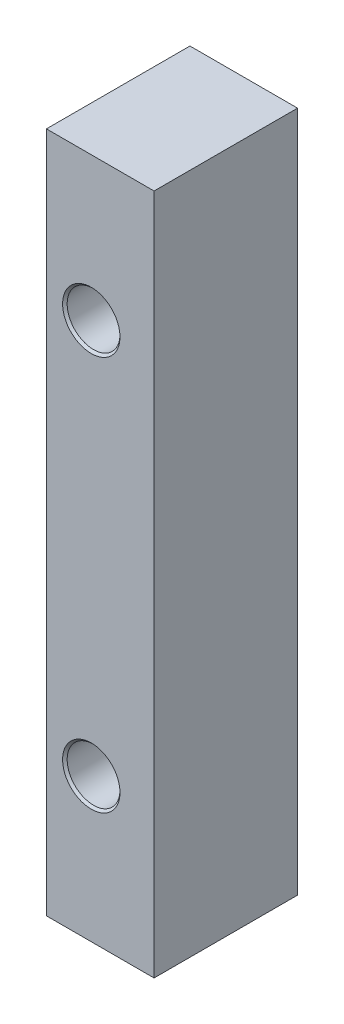
ISO-10303-21;
HEADER;
FILE_DESCRIPTION(('STEP AP214'),'2;1');
FILE_NAME('part.step','',(''),(''),'','','');
FILE_SCHEMA(('AUTOMOTIVE_DESIGN { 1 0 10303 214 1 1 1 1 }'));
ENDSEC;
DATA;
#1=APPLICATION_CONTEXT('core data for automotive mechanical design processes');
#2=APPLICATION_PROTOCOL_DEFINITION('international standard','automotive_design',2000,#1);
#3=PRODUCT_CONTEXT('',#1,'mechanical');
#4=PRODUCT('Part','Part','',(#3));
#5=PRODUCT_RELATED_PRODUCT_CATEGORY('part','',(#4));
#6=PRODUCT_DEFINITION_FORMATION('','',#4);
#7=PRODUCT_DEFINITION_CONTEXT('part definition',#1,'design');
#8=PRODUCT_DEFINITION('design','',#6,#7);
#9=PRODUCT_DEFINITION_SHAPE('','',#8);
#10=(LENGTH_UNIT() NAMED_UNIT(*) SI_UNIT(.MILLI.,.METRE.));
#11=(NAMED_UNIT(*) PLANE_ANGLE_UNIT() SI_UNIT($,.RADIAN.));
#12=(NAMED_UNIT(*) SI_UNIT($,.STERADIAN.) SOLID_ANGLE_UNIT());
#13=UNCERTAINTY_MEASURE_WITH_UNIT(LENGTH_MEASURE(1.E-05),#10,'distance_accuracy_value','');
#14=(GEOMETRIC_REPRESENTATION_CONTEXT(3) GLOBAL_UNCERTAINTY_ASSIGNED_CONTEXT((#13)) GLOBAL_UNIT_ASSIGNED_CONTEXT((#10,
#11,#12)) REPRESENTATION_CONTEXT('',''));
#15=CARTESIAN_POINT('',(0.,0.,0.));
#16=DIRECTION('',(0.,0.,1.));
#17=DIRECTION('',(1.,0.,0.));
#18=AXIS2_PLACEMENT_3D('',#15,#16,#17);
#19=CARTESIAN_POINT('',(3.,-19.,8.));
#20=DIRECTION('',(-1.,0.,0.));
#21=DIRECTION('',(0.,0.,1.));
#22=AXIS2_PLACEMENT_3D('',#19,#20,#21);
#23=PLANE('',#22);
#24=DIRECTION('',(0.,1.,0.));
#25=VECTOR('',#24,1.);
#26=CARTESIAN_POINT('',(3.,-19.,0.));
#27=LINE('',#26,#25);
#28=CARTESIAN_POINT('',(3.,-19.,0.));
#29=VERTEX_POINT('',#28);
#30=CARTESIAN_POINT('',(3.,19.,0.));
#31=VERTEX_POINT('',#30);
#32=EDGE_CURVE('E155',#29,#31,#27,.T.);
#33=ORIENTED_EDGE('',*,*,#32,.T.);
#34=DIRECTION('',(0.,0.,-1.));
#35=VECTOR('',#34,1.);
#36=CARTESIAN_POINT('',(3.,19.,8.));
#37=LINE('',#36,#35);
#38=CARTESIAN_POINT('',(3.,19.,8.));
#39=VERTEX_POINT('',#38);
#40=EDGE_CURVE('E136',#39,#31,#37,.T.);
#41=ORIENTED_EDGE('',*,*,#40,.F.);
#42=DIRECTION('',(0.,1.,0.));
#43=VECTOR('',#42,1.);
#44=CARTESIAN_POINT('',(3.,-19.,8.));
#45=LINE('',#44,#43);
#46=CARTESIAN_POINT('',(3.,-19.,8.));
#47=VERTEX_POINT('',#46);
#48=EDGE_CURVE('E143',#47,#39,#45,.T.);
#49=ORIENTED_EDGE('',*,*,#48,.F.);
#50=DIRECTION('',(0.,0.,-1.));
#51=VECTOR('',#50,1.);
#52=CARTESIAN_POINT('',(3.,-19.,8.));
#53=LINE('',#52,#51);
#54=EDGE_CURVE('E343',#47,#29,#53,.T.);
#55=ORIENTED_EDGE('',*,*,#54,.T.);
#56=EDGE_LOOP('',(#33,#41,#49,#55));
#57=FACE_BOUND('',#56,.T.);
#58=ADVANCED_FACE('F31',(#57),#23,.F.);
#59=CARTESIAN_POINT('',(-3.,19.,8.));
#60=DIRECTION('',(0.,-1.,0.));
#61=DIRECTION('',(0.,0.,-1.));
#62=AXIS2_PLACEMENT_3D('',#59,#60,#61);
#63=PLANE('',#62);
#64=DIRECTION('',(-1.,0.,0.));
#65=VECTOR('',#64,1.);
#66=CARTESIAN_POINT('',(-3.,19.,0.));
#67=LINE('',#66,#65);
#68=CARTESIAN_POINT('',(-3.,19.,0.));
#69=VERTEX_POINT('',#68);
#70=EDGE_CURVE('E345',#31,#69,#67,.T.);
#71=ORIENTED_EDGE('',*,*,#70,.T.);
#72=DIRECTION('',(0.,0.,-1.));
#73=VECTOR('',#72,1.);
#74=CARTESIAN_POINT('',(-3.,19.,8.));
#75=LINE('',#74,#73);
#76=CARTESIAN_POINT('',(-3.,19.,8.));
#77=VERTEX_POINT('',#76);
#78=EDGE_CURVE('E139',#77,#69,#75,.T.);
#79=ORIENTED_EDGE('',*,*,#78,.F.);
#80=DIRECTION('',(-1.,0.,0.));
#81=VECTOR('',#80,1.);
#82=CARTESIAN_POINT('',(-3.,19.,8.));
#83=LINE('',#82,#81);
#84=EDGE_CURVE('E132',#39,#77,#83,.T.);
#85=ORIENTED_EDGE('',*,*,#84,.F.);
#86=ORIENTED_EDGE('',*,*,#40,.T.);
#87=EDGE_LOOP('',(#71,#79,#85,#86));
#88=FACE_BOUND('',#87,.T.);
#89=ADVANCED_FACE('F134',(#88),#63,.F.);
#90=CARTESIAN_POINT('',(-3.,-19.,8.));
#91=DIRECTION('',(1.,0.,0.));
#92=DIRECTION('',(0.,0.,-1.));
#93=AXIS2_PLACEMENT_3D('',#90,#91,#92);
#94=PLANE('',#93);
#95=DIRECTION('',(0.,-1.,0.));
#96=VECTOR('',#95,1.);
#97=CARTESIAN_POINT('',(-3.,-19.,0.));
#98=LINE('',#97,#96);
#99=CARTESIAN_POINT('',(-3.,9.3375451121956,0.));
#100=VERTEX_POINT('',#99);
#101=CARTESIAN_POINT('',(-3.,-9.33754511219559,0.));
#102=VERTEX_POINT('',#101);
#103=EDGE_CURVE('E350',#100,#102,#98,.T.);
#104=ORIENTED_EDGE('',*,*,#103,.T.);
#105=DIRECTION('',(0.,0.,1.));
#106=VECTOR('',#105,1.);
#107=CARTESIAN_POINT('',(-3.,-9.33754511219559,8.));
#108=LINE('',#107,#106);
#109=CARTESIAN_POINT('',(-3.,-9.33754511219559,2.8448));
#110=VERTEX_POINT('',#109);
#111=EDGE_CURVE('E174',#102,#110,#108,.T.);
#112=ORIENTED_EDGE('',*,*,#111,.T.);
#113=DIRECTION('',(0.,-1.,0.));
#114=VECTOR('',#113,1.);
#115=CARTESIAN_POINT('',(-3.,-19.,2.8448));
#116=LINE('',#115,#114);
#117=CARTESIAN_POINT('',(-3.,-12.6624548878044,2.8448));
#118=VERTEX_POINT('',#117);
#119=EDGE_CURVE('E156',#110,#118,#116,.T.);
#120=ORIENTED_EDGE('',*,*,#119,.T.);
#121=DIRECTION('',(0.,0.,-1.));
#122=VECTOR('',#121,1.);
#123=CARTESIAN_POINT('',(-3.,-12.6624548878044,8.));
#124=LINE('',#123,#122);
#125=CARTESIAN_POINT('',(-3.,-12.6624548878044,0.));
#126=VERTEX_POINT('',#125);
#127=EDGE_CURVE('E171',#118,#126,#124,.T.);
#128=ORIENTED_EDGE('',*,*,#127,.T.);
#129=CARTESIAN_POINT('',(-3.,-19.,0.));
#130=VERTEX_POINT('',#129);
#131=EDGE_CURVE('E347',#126,#130,#98,.T.);
#132=ORIENTED_EDGE('',*,*,#131,.T.);
#133=DIRECTION('',(0.,0.,-1.));
#134=VECTOR('',#133,1.);
#135=CARTESIAN_POINT('',(-3.,-19.,8.));
#136=LINE('',#135,#134);
#137=CARTESIAN_POINT('',(-3.,-19.,8.));
#138=VERTEX_POINT('',#137);
#139=EDGE_CURVE('E160',#138,#130,#136,.T.);
#140=ORIENTED_EDGE('',*,*,#139,.F.);
#141=DIRECTION('',(0.,-1.,0.));
#142=VECTOR('',#141,1.);
#143=CARTESIAN_POINT('',(-3.,-19.,8.));
#144=LINE('',#143,#142);
#145=EDGE_CURVE('E142',#77,#138,#144,.T.);
#146=ORIENTED_EDGE('',*,*,#145,.F.);
#147=ORIENTED_EDGE('',*,*,#78,.T.);
#148=CARTESIAN_POINT('',(-3.,12.6624548878044,0.));
#149=VERTEX_POINT('',#148);
#150=EDGE_CURVE('E348',#69,#149,#98,.T.);
#151=ORIENTED_EDGE('',*,*,#150,.T.);
#152=DIRECTION('',(0.,0.,1.));
#153=VECTOR('',#152,1.);
#154=CARTESIAN_POINT('',(-3.,12.6624548878044,8.));
#155=LINE('',#154,#153);
#156=CARTESIAN_POINT('',(-3.,12.6624548878044,2.8448));
#157=VERTEX_POINT('',#156);
#158=EDGE_CURVE('E165',#149,#157,#155,.T.);
#159=ORIENTED_EDGE('',*,*,#158,.T.);
#160=DIRECTION('',(0.,-1.,0.));
#161=VECTOR('',#160,1.);
#162=CARTESIAN_POINT('',(-3.,-19.,2.8448));
#163=LINE('',#162,#161);
#164=CARTESIAN_POINT('',(-3.,9.3375451121956,2.8448));
#165=VERTEX_POINT('',#164);
#166=EDGE_CURVE('E158',#157,#165,#163,.T.);
#167=ORIENTED_EDGE('',*,*,#166,.T.);
#168=DIRECTION('',(0.,0.,-1.));
#169=VECTOR('',#168,1.);
#170=CARTESIAN_POINT('',(-3.,9.3375451121956,8.));
#171=LINE('',#170,#169);
#172=EDGE_CURVE('E168',#165,#100,#171,.T.);
#173=ORIENTED_EDGE('',*,*,#172,.T.);
#174=EDGE_LOOP('',(#104,#112,#120,#128,#132,#140,#146,#147,#151,#159,#167,#173));
#175=FACE_BOUND('',#174,.T.);
#176=ADVANCED_FACE('F236',(#175),#94,.F.);
#177=CARTESIAN_POINT('',(-3.,-19.,8.));
#178=DIRECTION('',(0.,1.,0.));
#179=DIRECTION('',(0.,0.,1.));
#180=AXIS2_PLACEMENT_3D('',#177,#178,#179);
#181=PLANE('',#180);
#182=DIRECTION('',(1.,0.,0.));
#183=VECTOR('',#182,1.);
#184=CARTESIAN_POINT('',(-3.,-19.,0.));
#185=LINE('',#184,#183);
#186=EDGE_CURVE('E152',#130,#29,#185,.T.);
#187=ORIENTED_EDGE('',*,*,#186,.T.);
#188=ORIENTED_EDGE('',*,*,#54,.F.);
#189=DIRECTION('',(1.,0.,0.));
#190=VECTOR('',#189,1.);
#191=CARTESIAN_POINT('',(-3.,-19.,8.));
#192=LINE('',#191,#190);
#193=EDGE_CURVE('E148',#138,#47,#192,.T.);
#194=ORIENTED_EDGE('',*,*,#193,.F.);
#195=ORIENTED_EDGE('',*,*,#139,.T.);
#196=EDGE_LOOP('',(#187,#188,#194,#195));
#197=FACE_BOUND('',#196,.T.);
#198=ADVANCED_FACE('F229',(#197),#181,.F.);
#199=CARTESIAN_POINT('',(3.,19.,8.));
#200=DIRECTION('',(0.,0.,-1.));
#201=DIRECTION('',(-1.,0.,0.));
#202=AXIS2_PLACEMENT_3D('',#199,#200,#201);
#203=PLANE('',#202);
#204=CARTESIAN_POINT('',(-0.5,11.,8.));
#205=DIRECTION('',(0.,0.,-1.));
#206=DIRECTION('',(-1.,0.,0.));
#207=AXIS2_PLACEMENT_3D('',#204,#205,#206);
#208=CIRCLE('',#207,1.6002);
#209=CARTESIAN_POINT('',(-2.1002,11.,8.));
#210=VERTEX_POINT('',#209);
#211=EDGE_CURVE('E384',#210,#210,#208,.T.);
#212=ORIENTED_EDGE('',*,*,#211,.T.);
#213=EDGE_LOOP('',(#212));
#214=FACE_BOUND('',#213,.T.);
#215=CARTESIAN_POINT('',(-0.5,-11.,8.));
#216=DIRECTION('',(0.,0.,-1.));
#217=DIRECTION('',(-1.,0.,0.));
#218=AXIS2_PLACEMENT_3D('',#215,#216,#217);
#219=CIRCLE('',#218,1.6002);
#220=CARTESIAN_POINT('',(-2.1002,-11.,8.));
#221=VERTEX_POINT('',#220);
#222=EDGE_CURVE('E315',#221,#221,#219,.T.);
#223=ORIENTED_EDGE('',*,*,#222,.T.);
#224=EDGE_LOOP('',(#223));
#225=FACE_BOUND('',#224,.T.);
#226=ORIENTED_EDGE('',*,*,#48,.T.);
#227=ORIENTED_EDGE('',*,*,#84,.T.);
#228=ORIENTED_EDGE('',*,*,#145,.T.);
#229=ORIENTED_EDGE('',*,*,#193,.T.);
#230=EDGE_LOOP('',(#226,#227,#228,#229));
#231=FACE_BOUND('',#230,.T.);
#232=ADVANCED_FACE('F146',(#214,#225,#231),#203,.F.);
#233=CARTESIAN_POINT('',(3.,19.,0.));
#234=DIRECTION('',(0.,0.,-1.));
#235=DIRECTION('',(-1.,0.,0.));
#236=AXIS2_PLACEMENT_3D('',#233,#234,#235);
#237=PLANE('',#236);
#238=CARTESIAN_POINT('',(-0.5,-11.,0.));
#239=DIRECTION('',(0.,0.,-1.));
#240=DIRECTION('',(-1.,0.,0.));
#241=AXIS2_PLACEMENT_3D('',#238,#239,#240);
#242=CIRCLE('',#241,2.90576);
#243=CARTESIAN_POINT('',(-2.88304335898056,-9.33730774741125,0.));
#244=VERTEX_POINT('',#243);
#245=CARTESIAN_POINT('',(-2.88304335898056,-12.6626922525887,0.));
#246=VERTEX_POINT('',#245);
#247=EDGE_CURVE('E324',#244,#246,#242,.T.);
#248=ORIENTED_EDGE('',*,*,#247,.F.);
#249=DIRECTION('',(-0.999997940549001,-0.00202950677646933,0.));
#250=VECTOR('',#249,1.);
#251=CARTESIAN_POINT('',(3.05748640800559,-9.32525137716383,0.));
#252=LINE('',#251,#250);
#253=EDGE_CURVE('E263',#244,#102,#252,.T.);
#254=ORIENTED_EDGE('',*,*,#253,.T.);
#255=ORIENTED_EDGE('',*,*,#103,.F.);
#256=DIRECTION('',(-0.999997940549001,0.00202950677646934,0.));
#257=VECTOR('',#256,1.);
#258=CARTESIAN_POINT('',(2.98036530932721,9.32540789527856,0.));
#259=LINE('',#258,#257);
#260=CARTESIAN_POINT('',(-2.88304335898056,9.33730774741126,0.));
#261=VERTEX_POINT('',#260);
#262=EDGE_CURVE('E268',#100,#261,#259,.F.);
#263=ORIENTED_EDGE('',*,*,#262,.T.);
#264=CARTESIAN_POINT('',(-0.5,11.,0.));
#265=DIRECTION('',(0.,0.,-1.));
#266=DIRECTION('',(-1.,0.,0.));
#267=AXIS2_PLACEMENT_3D('',#264,#265,#266);
#268=CIRCLE('',#267,2.90576);
#269=CARTESIAN_POINT('',(-2.88304335898056,12.6626922525888,0.));
#270=VERTEX_POINT('',#269);
#271=EDGE_CURVE('E382',#270,#261,#268,.T.);
#272=ORIENTED_EDGE('',*,*,#271,.F.);
#273=DIRECTION('',(-0.999997940549001,-0.00202950677646933,0.));
#274=VECTOR('',#273,1.);
#275=CARTESIAN_POINT('',(3.012837350876,12.6746580070855,0.));
#276=LINE('',#275,#274);
#277=EDGE_CURVE('E267',#270,#149,#276,.T.);
#278=ORIENTED_EDGE('',*,*,#277,.T.);
#279=ORIENTED_EDGE('',*,*,#150,.F.);
#280=ORIENTED_EDGE('',*,*,#70,.F.);
#281=ORIENTED_EDGE('',*,*,#32,.F.);
#282=ORIENTED_EDGE('',*,*,#186,.F.);
#283=ORIENTED_EDGE('',*,*,#131,.F.);
#284=DIRECTION('',(-0.999997940549001,0.00202950677646934,0.));
#285=VECTOR('',#284,1.);
#286=CARTESIAN_POINT('',(2.93571625219762,-12.6745014889708,0.));
#287=LINE('',#286,#285);
#288=EDGE_CURVE('E273',#126,#246,#287,.F.);
#289=ORIENTED_EDGE('',*,*,#288,.T.);
#290=EDGE_LOOP('',(#248,#254,#255,#263,#272,#278,#279,#280,#281,#282,#283,#289));
#291=FACE_BOUND('',#290,.T.);
#292=ADVANCED_FACE('F213',(#291),#237,.T.);
#293=CARTESIAN_POINT('',(1.1002,-11.,2.8448));
#294=DIRECTION('',(0.,0.,1.));
#295=DIRECTION('',(1.,0.,0.));
#296=AXIS2_PLACEMENT_3D('',#293,#294,#295);
#297=PLANE('',#296);
#298=CARTESIAN_POINT('',(-0.5,-11.,2.8448));
#299=DIRECTION('',(0.,0.,-1.));
#300=DIRECTION('',(-1.,0.,0.));
#301=AXIS2_PLACEMENT_3D('',#298,#299,#300);
#302=CIRCLE('',#301,1.6002);
#303=CARTESIAN_POINT('',(-2.1002,-11.,2.8448));
#304=VERTEX_POINT('',#303);
#305=EDGE_CURVE('E332',#304,#304,#302,.T.);
#306=ORIENTED_EDGE('',*,*,#305,.F.);
#307=EDGE_LOOP('',(#306));
#308=FACE_BOUND('',#307,.T.);
#309=ORIENTED_EDGE('',*,*,#119,.F.);
#310=DIRECTION('',(0.999997940549001,0.00202950677646933,0.));
#311=VECTOR('',#310,1.);
#312=CARTESIAN_POINT('',(1.09680915518356,-9.3292305931299,2.8448));
#313=LINE('',#312,#311);
#314=CARTESIAN_POINT('',(-2.72618572726878,-9.33698940312913,2.8448));
#315=VERTEX_POINT('',#314);
#316=EDGE_CURVE('E363',#110,#315,#313,.T.);
#317=ORIENTED_EDGE('',*,*,#316,.T.);
#318=CARTESIAN_POINT('',(-0.5,-11.,2.8448));
#319=DIRECTION('',(0.,0.,-1.));
#320=DIRECTION('',(-1.,0.,0.));
#321=AXIS2_PLACEMENT_3D('',#318,#319,#320);
#322=CIRCLE('',#321,2.77876);
#323=CARTESIAN_POINT('',(-2.72618572726878,-12.6630105968709,2.8448));
#324=VERTEX_POINT('',#323);
#325=EDGE_CURVE('E329',#315,#324,#322,.T.);
#326=ORIENTED_EDGE('',*,*,#325,.T.);
#327=DIRECTION('',(0.999997940549001,-0.00202950677646934,0.));
#328=VECTOR('',#327,1.);
#329=CARTESIAN_POINT('',(1.09680915518356,-12.6707694068701,2.8448));
#330=LINE('',#329,#328);
#331=EDGE_CURVE('E367',#324,#118,#330,.F.);
#332=ORIENTED_EDGE('',*,*,#331,.T.);
#333=EDGE_LOOP('',(#309,#317,#326,#332));
#334=FACE_BOUND('',#333,.T.);
#335=ADVANCED_FACE('F209',(#308,#334),#297,.F.);
#336=CARTESIAN_POINT('',(-0.5,-11.,0.));
#337=DIRECTION('',(0.,0.,-1.));
#338=DIRECTION('',(-1.,0.,0.));
#339=AXIS2_PLACEMENT_3D('',#336,#337,#338);
#340=CYLINDRICAL_SURFACE('',#339,2.77876);
#341=ORIENTED_EDGE('',*,*,#325,.F.);
#342=DIRECTION('',(0.,0.,-1.));
#343=VECTOR('',#342,1.);
#344=CARTESIAN_POINT('',(-2.72618572726878,-9.33698940312913,0.));
#345=LINE('',#344,#343);
#346=CARTESIAN_POINT('',(-2.72618572726878,-9.33698940312913,0.127000000000001));
#347=VERTEX_POINT('',#346);
#348=EDGE_CURVE('E179',#315,#347,#345,.T.);
#349=ORIENTED_EDGE('',*,*,#348,.T.);
#350=CARTESIAN_POINT('',(-0.5,-11.,0.127000000000001));
#351=DIRECTION('',(0.,0.,-1.));
#352=DIRECTION('',(-1.,0.,0.));
#353=AXIS2_PLACEMENT_3D('',#350,#351,#352);
#354=CIRCLE('',#353,2.77876);
#355=CARTESIAN_POINT('',(-2.72618572726878,-12.6630105968709,0.127000000000001));
#356=VERTEX_POINT('',#355);
#357=EDGE_CURVE('E326',#347,#356,#354,.T.);
#358=ORIENTED_EDGE('',*,*,#357,.T.);
#359=DIRECTION('',(0.,0.,-1.));
#360=VECTOR('',#359,1.);
#361=CARTESIAN_POINT('',(-2.72618572726878,-12.6630105968709,0.));
#362=LINE('',#361,#360);
#363=EDGE_CURVE('E177',#356,#324,#362,.F.);
#364=ORIENTED_EDGE('',*,*,#363,.T.);
#365=EDGE_LOOP('',(#341,#349,#358,#364));
#366=FACE_BOUND('',#365,.T.);
#367=ADVANCED_FACE('F202',(#366),#340,.F.);
#368=CARTESIAN_POINT('',(-0.5,-11.,0.));
#369=DIRECTION('',(0.,0.,-1.));
#370=DIRECTION('',(-1.,0.,0.));
#371=AXIS2_PLACEMENT_3D('',#368,#369,#370);
#372=CONICAL_SURFACE('',#371,2.90576,0.785398163397448);
#373=ORIENTED_EDGE('',*,*,#357,.F.);
#374=CARTESIAN_POINT('',(-2.72618572726878,-9.33698940312913,0.127000000000001));
#375=CARTESIAN_POINT('',(-2.75245019923403,-9.33704270716274,0.105983429878905));
#376=CARTESIAN_POINT('',(-2.77865390692182,-9.33709588787459,0.0848918095223424));
#377=CARTESIAN_POINT('',(-2.83093978411433,-9.3372020026352,0.0425584761337284));
#378=CARTESIAN_POINT('',(-2.8570219536638,-9.33725493668406,0.0213167631569572));
#379=CARTESIAN_POINT('',(-2.88304335898056,-9.33730774741125,0.));
#380=B_SPLINE_CURVE_WITH_KNOTS('',3,(#374,#375,#376,#377,#378,#379),.UNSPECIFIED.,.F.,.F.,(4,2,
4),(0.,0.100913042597901,0.201826048030678),.UNSPECIFIED.);
#381=EDGE_CURVE('E188',#347,#244,#380,.T.);
#382=ORIENTED_EDGE('',*,*,#381,.T.);
#383=ORIENTED_EDGE('',*,*,#247,.T.);
#384=CARTESIAN_POINT('',(-2.88304335898056,-12.6626922525887,0.));
#385=CARTESIAN_POINT('',(-2.8570219536638,-12.6627450633159,0.0213167631569573));
#386=CARTESIAN_POINT('',(-2.83093978411433,-12.6627979973648,0.0425584761337285));
#387=CARTESIAN_POINT('',(-2.77865390692182,-12.6629041121254,0.0848918095223423));
#388=CARTESIAN_POINT('',(-2.75245019923403,-12.6629572928372,0.105983429878905));
#389=CARTESIAN_POINT('',(-2.72618572726878,-12.6630105968709,0.127000000000001));
#390=B_SPLINE_CURVE_WITH_KNOTS('',3,(#384,#385,#386,#387,#388,#389),.UNSPECIFIED.,.F.,.F.,(4,2,
4),(0.,0.100913005432776,0.201826048030677),.UNSPECIFIED.);
#391=EDGE_CURVE('E181',#246,#356,#390,.T.);
#392=ORIENTED_EDGE('',*,*,#391,.T.);
#393=EDGE_LOOP('',(#373,#382,#383,#392));
#394=FACE_BOUND('',#393,.T.);
#395=ADVANCED_FACE('F196',(#394),#372,.F.);
#396=CARTESIAN_POINT('',(-0.5,-11.,7.873));
#397=DIRECTION('',(0.,0.,1.));
#398=DIRECTION('',(1.,0.,0.));
#399=AXIS2_PLACEMENT_3D('',#396,#397,#398);
#400=CONICAL_SURFACE('',#399,1.4732,0.785398163397448);
#401=ORIENTED_EDGE('',*,*,#222,.F.);
#402=EDGE_LOOP('',(#401));
#403=FACE_BOUND('',#402,.T.);
#404=CARTESIAN_POINT('',(-0.5,-11.,7.873));
#405=DIRECTION('',(0.,0.,-1.));
#406=DIRECTION('',(-1.,0.,0.));
#407=AXIS2_PLACEMENT_3D('',#404,#405,#406);
#408=CIRCLE('',#407,1.4732);
#409=CARTESIAN_POINT('',(-1.9732,-11.,7.873));
#410=VERTEX_POINT('',#409);
#411=EDGE_CURVE('E338',#410,#410,#408,.T.);
#412=ORIENTED_EDGE('',*,*,#411,.T.);
#413=EDGE_LOOP('',(#412));
#414=FACE_BOUND('',#413,.T.);
#415=ADVANCED_FACE('F201',(#403,#414),#400,.F.);
#416=CARTESIAN_POINT('',(-0.5,-11.,0.));
#417=DIRECTION('',(0.,0.,-1.));
#418=DIRECTION('',(-1.,0.,0.));
#419=AXIS2_PLACEMENT_3D('',#416,#417,#418);
#420=CYLINDRICAL_SURFACE('',#419,1.4732);
#421=ORIENTED_EDGE('',*,*,#411,.F.);
#422=EDGE_LOOP('',(#421));
#423=FACE_BOUND('',#422,.T.);
#424=CARTESIAN_POINT('',(-0.5,-11.,2.9718));
#425=DIRECTION('',(0.,0.,-1.));
#426=DIRECTION('',(-1.,0.,0.));
#427=AXIS2_PLACEMENT_3D('',#424,#425,#426);
#428=CIRCLE('',#427,1.4732);
#429=CARTESIAN_POINT('',(-1.9732,-11.,2.9718));
#430=VERTEX_POINT('',#429);
#431=EDGE_CURVE('E335',#430,#430,#428,.T.);
#432=ORIENTED_EDGE('',*,*,#431,.T.);
#433=EDGE_LOOP('',(#432));
#434=FACE_BOUND('',#433,.T.);
#435=ADVANCED_FACE('F219',(#423,#434),#420,.F.);
#436=CARTESIAN_POINT('',(-0.5,-11.,2.8448));
#437=DIRECTION('',(0.,0.,-1.));
#438=DIRECTION('',(-1.,0.,0.));
#439=AXIS2_PLACEMENT_3D('',#436,#437,#438);
#440=CONICAL_SURFACE('',#439,1.6002,0.785398163397448);
#441=ORIENTED_EDGE('',*,*,#431,.F.);
#442=EDGE_LOOP('',(#441));
#443=FACE_BOUND('',#442,.T.);
#444=ORIENTED_EDGE('',*,*,#305,.T.);
#445=EDGE_LOOP('',(#444));
#446=FACE_BOUND('',#445,.T.);
#447=ADVANCED_FACE('F215',(#443,#446),#440,.F.);
#448=CARTESIAN_POINT('',(1.1002,11.,2.8448));
#449=DIRECTION('',(0.,0.,1.));
#450=DIRECTION('',(1.,0.,0.));
#451=AXIS2_PLACEMENT_3D('',#448,#449,#450);
#452=PLANE('',#451);
#453=CARTESIAN_POINT('',(-0.5,11.,2.8448));
#454=DIRECTION('',(0.,0.,-1.));
#455=DIRECTION('',(-1.,0.,0.));
#456=AXIS2_PLACEMENT_3D('',#453,#454,#455);
#457=CIRCLE('',#456,1.6002);
#458=CARTESIAN_POINT('',(-2.1002,11.,2.8448));
#459=VERTEX_POINT('',#458);
#460=EDGE_CURVE('E313',#459,#459,#457,.T.);
#461=ORIENTED_EDGE('',*,*,#460,.F.);
#462=EDGE_LOOP('',(#461));
#463=FACE_BOUND('',#462,.T.);
#464=ORIENTED_EDGE('',*,*,#166,.F.);
#465=DIRECTION('',(0.999997940549001,0.00202950677646933,0.));
#466=VECTOR('',#465,1.);
#467=CARTESIAN_POINT('',(1.09680915518356,12.6707694068701,2.8448));
#468=LINE('',#467,#466);
#469=CARTESIAN_POINT('',(-2.72618572726878,12.6630105968709,2.8448));
#470=VERTEX_POINT('',#469);
#471=EDGE_CURVE('E11',#157,#470,#468,.T.);
#472=ORIENTED_EDGE('',*,*,#471,.T.);
#473=CARTESIAN_POINT('',(-0.5,11.,2.8448));
#474=DIRECTION('',(0.,0.,-1.));
#475=DIRECTION('',(-1.,0.,0.));
#476=AXIS2_PLACEMENT_3D('',#473,#474,#475);
#477=CIRCLE('',#476,2.77876);
#478=CARTESIAN_POINT('',(-2.72618572726878,9.33698940312914,2.8448));
#479=VERTEX_POINT('',#478);
#480=EDGE_CURVE('E318',#470,#479,#477,.T.);
#481=ORIENTED_EDGE('',*,*,#480,.T.);
#482=DIRECTION('',(0.999997940549001,-0.00202950677646934,0.));
#483=VECTOR('',#482,1.);
#484=CARTESIAN_POINT('',(1.09680915518356,9.32923059312991,2.8448));
#485=LINE('',#484,#483);
#486=EDGE_CURVE('E40',#479,#165,#485,.F.);
#487=ORIENTED_EDGE('',*,*,#486,.T.);
#488=EDGE_LOOP('',(#464,#472,#481,#487));
#489=FACE_BOUND('',#488,.T.);
#490=ADVANCED_FACE('F218',(#463,#489),#452,.F.);
#491=CARTESIAN_POINT('',(-0.5,11.,0.));
#492=DIRECTION('',(0.,0.,-1.));
#493=DIRECTION('',(-1.,0.,0.));
#494=AXIS2_PLACEMENT_3D('',#491,#492,#493);
#495=CYLINDRICAL_SURFACE('',#494,2.77876);
#496=CARTESIAN_POINT('',(-0.5,11.,0.127000000000001));
#497=DIRECTION('',(0.,0.,-1.));
#498=DIRECTION('',(-1.,0.,0.));
#499=AXIS2_PLACEMENT_3D('',#496,#497,#498);
#500=CIRCLE('',#499,2.77876);
#501=CARTESIAN_POINT('',(-2.72618572726878,12.6630105968709,0.127000000000001));
#502=VERTEX_POINT('',#501);
#503=CARTESIAN_POINT('',(-2.72618572726878,9.33698940312914,0.127000000000001));
#504=VERTEX_POINT('',#503);
#505=EDGE_CURVE('E383',#502,#504,#500,.T.);
#506=ORIENTED_EDGE('',*,*,#505,.T.);
#507=DIRECTION('',(0.,0.,-1.));
#508=VECTOR('',#507,1.);
#509=CARTESIAN_POINT('',(-2.72618572726878,9.33698940312914,0.));
#510=LINE('',#509,#508);
#511=EDGE_CURVE('E47',#504,#479,#510,.F.);
#512=ORIENTED_EDGE('',*,*,#511,.T.);
#513=ORIENTED_EDGE('',*,*,#480,.F.);
#514=DIRECTION('',(0.,0.,-1.));
#515=VECTOR('',#514,1.);
#516=CARTESIAN_POINT('',(-2.72618572726878,12.6630105968709,0.));
#517=LINE('',#516,#515);
#518=EDGE_CURVE('E361',#470,#502,#517,.T.);
#519=ORIENTED_EDGE('',*,*,#518,.T.);
#520=EDGE_LOOP('',(#506,#512,#513,#519));
#521=FACE_BOUND('',#520,.T.);
#522=ADVANCED_FACE('F293',(#521),#495,.F.);
#523=CARTESIAN_POINT('',(-0.5,11.,0.));
#524=DIRECTION('',(0.,0.,-1.));
#525=DIRECTION('',(-1.,0.,0.));
#526=AXIS2_PLACEMENT_3D('',#523,#524,#525);
#527=CONICAL_SURFACE('',#526,2.90576,0.785398163397448);
#528=ORIENTED_EDGE('',*,*,#271,.T.);
#529=CARTESIAN_POINT('',(-2.88304335898056,9.33730774741126,0.));
#530=CARTESIAN_POINT('',(-2.8570219536638,9.33725493668407,0.0213167631569573));
#531=CARTESIAN_POINT('',(-2.83093978411433,9.33720200263521,0.0425584761337285));
#532=CARTESIAN_POINT('',(-2.77865390692182,9.3370958878746,0.0848918095223423));
#533=CARTESIAN_POINT('',(-2.75245019923403,9.33704270716275,0.105983429878905));
#534=CARTESIAN_POINT('',(-2.72618572726878,9.33698940312914,0.127000000000001));
#535=B_SPLINE_CURVE_WITH_KNOTS('',3,(#529,#530,#531,#532,#533,#534),.UNSPECIFIED.,.F.,.F.,(4,2,
4),(0.,0.100913005432776,0.201826048030677),.UNSPECIFIED.);
#536=EDGE_CURVE('E284',#261,#504,#535,.T.);
#537=ORIENTED_EDGE('',*,*,#536,.T.);
#538=ORIENTED_EDGE('',*,*,#505,.F.);
#539=CARTESIAN_POINT('',(-2.72618572726878,12.6630105968709,0.127000000000001));
#540=CARTESIAN_POINT('',(-2.75245019923403,12.6629572928373,0.105983429878905));
#541=CARTESIAN_POINT('',(-2.77865390692182,12.6629041121254,0.0848918095223424));
#542=CARTESIAN_POINT('',(-2.83093978411433,12.6627979973648,0.0425584761337284));
#543=CARTESIAN_POINT('',(-2.8570219536638,12.6627450633159,0.0213167631569572));
#544=CARTESIAN_POINT('',(-2.88304335898056,12.6626922525888,0.));
#545=B_SPLINE_CURVE_WITH_KNOTS('',3,(#539,#540,#541,#542,#543,#544),.UNSPECIFIED.,.F.,.F.,(4,2,
4),(0.,0.100913042597901,0.201826048030678),.UNSPECIFIED.);
#546=EDGE_CURVE('E278',#502,#270,#545,.T.);
#547=ORIENTED_EDGE('',*,*,#546,.T.);
#548=EDGE_LOOP('',(#528,#537,#538,#547));
#549=FACE_BOUND('',#548,.T.);
#550=ADVANCED_FACE('F289',(#549),#527,.F.);
#551=CARTESIAN_POINT('',(-0.5,11.,7.873));
#552=DIRECTION('',(0.,0.,1.));
#553=DIRECTION('',(1.,0.,0.));
#554=AXIS2_PLACEMENT_3D('',#551,#552,#553);
#555=CONICAL_SURFACE('',#554,1.4732,0.785398163397448);
#556=ORIENTED_EDGE('',*,*,#211,.F.);
#557=EDGE_LOOP('',(#556));
#558=FACE_BOUND('',#557,.T.);
#559=CARTESIAN_POINT('',(-0.5,11.,7.873));
#560=DIRECTION('',(0.,0.,-1.));
#561=DIRECTION('',(-1.,0.,0.));
#562=AXIS2_PLACEMENT_3D('',#559,#560,#561);
#563=CIRCLE('',#562,1.4732);
#564=CARTESIAN_POINT('',(-1.9732,11.,7.873));
#565=VERTEX_POINT('',#564);
#566=EDGE_CURVE('E309',#565,#565,#563,.T.);
#567=ORIENTED_EDGE('',*,*,#566,.T.);
#568=EDGE_LOOP('',(#567));
#569=FACE_BOUND('',#568,.T.);
#570=ADVANCED_FACE('F204',(#558,#569),#555,.F.);
#571=CARTESIAN_POINT('',(-0.5,11.,0.));
#572=DIRECTION('',(0.,0.,-1.));
#573=DIRECTION('',(-1.,0.,0.));
#574=AXIS2_PLACEMENT_3D('',#571,#572,#573);
#575=CYLINDRICAL_SURFACE('',#574,1.4732);
#576=ORIENTED_EDGE('',*,*,#566,.F.);
#577=EDGE_LOOP('',(#576));
#578=FACE_BOUND('',#577,.T.);
#579=CARTESIAN_POINT('',(-0.5,11.,2.9718));
#580=DIRECTION('',(0.,0.,-1.));
#581=DIRECTION('',(-1.,0.,0.));
#582=AXIS2_PLACEMENT_3D('',#579,#580,#581);
#583=CIRCLE('',#582,1.4732);
#584=CARTESIAN_POINT('',(-1.9732,11.,2.9718));
#585=VERTEX_POINT('',#584);
#586=EDGE_CURVE('E312',#585,#585,#583,.T.);
#587=ORIENTED_EDGE('',*,*,#586,.T.);
#588=EDGE_LOOP('',(#587));
#589=FACE_BOUND('',#588,.T.);
#590=ADVANCED_FACE('F255',(#578,#589),#575,.F.);
#591=CARTESIAN_POINT('',(-0.5,11.,2.8448));
#592=DIRECTION('',(0.,0.,-1.));
#593=DIRECTION('',(-1.,0.,0.));
#594=AXIS2_PLACEMENT_3D('',#591,#592,#593);
#595=CONICAL_SURFACE('',#594,1.6002,0.785398163397448);
#596=ORIENTED_EDGE('',*,*,#586,.F.);
#597=EDGE_LOOP('',(#596));
#598=FACE_BOUND('',#597,.T.);
#599=ORIENTED_EDGE('',*,*,#460,.T.);
#600=EDGE_LOOP('',(#599));
#601=FACE_BOUND('',#600,.T.);
#602=ADVANCED_FACE('F247',(#598,#601),#595,.F.);
#603=CARTESIAN_POINT('',(-3.,-9.33754511219559,0.));
#604=DIRECTION('',(0.00202950677646933,-0.999997940549001,0.));
#605=DIRECTION('',(0.999997940549001,0.00202950677646933,0.));
#606=AXIS2_PLACEMENT_3D('',#603,#604,#605);
#607=PLANE('',#606);
#608=ORIENTED_EDGE('',*,*,#381,.F.);
#609=ORIENTED_EDGE('',*,*,#348,.F.);
#610=ORIENTED_EDGE('',*,*,#316,.F.);
#611=ORIENTED_EDGE('',*,*,#111,.F.);
#612=ORIENTED_EDGE('',*,*,#253,.F.);
#613=EDGE_LOOP('',(#608,#609,#610,#611,#612));
#614=FACE_BOUND('',#613,.T.);
#615=ADVANCED_FACE('F244',(#614),#607,.T.);
#616=CARTESIAN_POINT('',(-3.,-12.6624548878044,0.));
#617=DIRECTION('',(-0.00202950677646934,-0.999997940549001,0.));
#618=DIRECTION('',(0.999997940549001,-0.00202950677646934,0.));
#619=AXIS2_PLACEMENT_3D('',#616,#617,#618);
#620=PLANE('',#619);
#621=ORIENTED_EDGE('',*,*,#331,.F.);
#622=ORIENTED_EDGE('',*,*,#363,.F.);
#623=ORIENTED_EDGE('',*,*,#391,.F.);
#624=ORIENTED_EDGE('',*,*,#288,.F.);
#625=ORIENTED_EDGE('',*,*,#127,.F.);
#626=EDGE_LOOP('',(#621,#622,#623,#624,#625));
#627=FACE_BOUND('',#626,.T.);
#628=ADVANCED_FACE('F194',(#627),#620,.F.);
#629=CARTESIAN_POINT('',(-3.,9.3375451121956,0.));
#630=DIRECTION('',(-0.00202950677646934,-0.999997940549001,0.));
#631=DIRECTION('',(0.999997940549001,-0.00202950677646934,0.));
#632=AXIS2_PLACEMENT_3D('',#629,#630,#631);
#633=PLANE('',#632);
#634=ORIENTED_EDGE('',*,*,#486,.F.);
#635=ORIENTED_EDGE('',*,*,#511,.F.);
#636=ORIENTED_EDGE('',*,*,#536,.F.);
#637=ORIENTED_EDGE('',*,*,#262,.F.);
#638=ORIENTED_EDGE('',*,*,#172,.F.);
#639=EDGE_LOOP('',(#634,#635,#636,#637,#638));
#640=FACE_BOUND('',#639,.T.);
#641=ADVANCED_FACE('F253',(#640),#633,.F.);
#642=CARTESIAN_POINT('',(-3.,12.6624548878044,0.));
#643=DIRECTION('',(0.00202950677646933,-0.999997940549001,0.));
#644=DIRECTION('',(0.999997940549001,0.00202950677646933,0.));
#645=AXIS2_PLACEMENT_3D('',#642,#643,#644);
#646=PLANE('',#645);
#647=ORIENTED_EDGE('',*,*,#546,.F.);
#648=ORIENTED_EDGE('',*,*,#518,.F.);
#649=ORIENTED_EDGE('',*,*,#471,.F.);
#650=ORIENTED_EDGE('',*,*,#158,.F.);
#651=ORIENTED_EDGE('',*,*,#277,.F.);
#652=EDGE_LOOP('',(#647,#648,#649,#650,#651));
#653=FACE_BOUND('',#652,.T.);
#654=ADVANCED_FACE('F33',(#653),#646,.T.);
#655=CLOSED_SHELL('',(#58,#89,#176,#198,#232,#292,#335,#367,#395,#415,#435,#447,#490,#522,#550,
#570,#590,#602,#615,#628,#641,#654));
#656=MANIFOLD_SOLID_BREP('B2',#655);
#657=ADVANCED_BREP_SHAPE_REPRESENTATION('',(#18,#656),#14);
#658=SHAPE_DEFINITION_REPRESENTATION(#9,#657);
ENDSEC;
END-ISO-10303-21;
